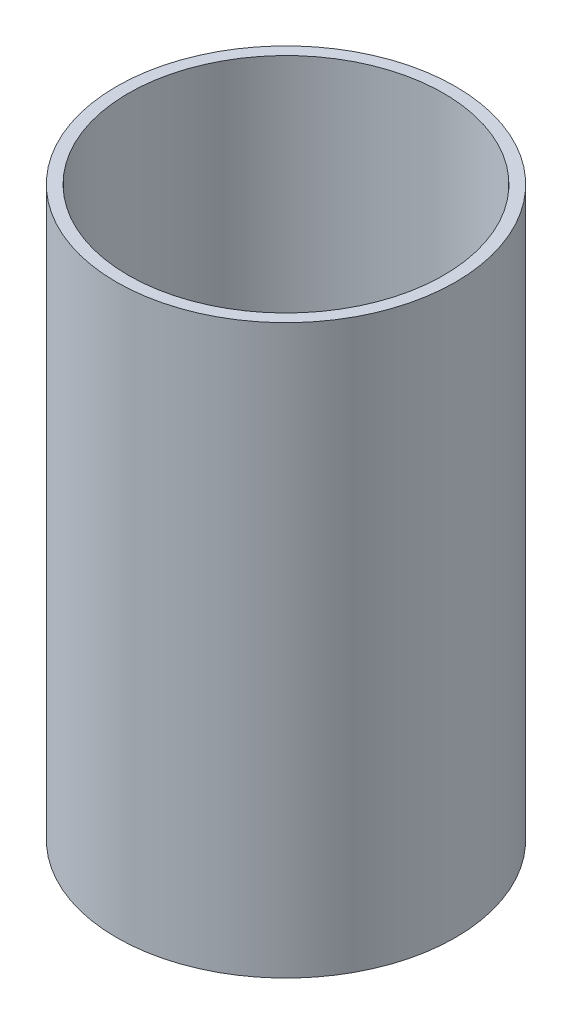
ISO-10303-21;
HEADER;
FILE_DESCRIPTION(('STEP AP214'),'2;1');
FILE_NAME('part.step','',(''),(''),'','','');
FILE_SCHEMA(('AUTOMOTIVE_DESIGN { 1 0 10303 214 1 1 1 1 }'));
ENDSEC;
DATA;
#1=APPLICATION_CONTEXT('core data for automotive mechanical design processes');
#2=APPLICATION_PROTOCOL_DEFINITION('international standard','automotive_design',2000,#1);
#3=PRODUCT_CONTEXT('',#1,'mechanical');
#4=PRODUCT('Part','Part','',(#3));
#5=PRODUCT_RELATED_PRODUCT_CATEGORY('part','',(#4));
#6=PRODUCT_DEFINITION_FORMATION('','',#4);
#7=PRODUCT_DEFINITION_CONTEXT('part definition',#1,'design');
#8=PRODUCT_DEFINITION('design','',#6,#7);
#9=PRODUCT_DEFINITION_SHAPE('','',#8);
#10=(LENGTH_UNIT() NAMED_UNIT(*) SI_UNIT(.MILLI.,.METRE.));
#11=(NAMED_UNIT(*) PLANE_ANGLE_UNIT() SI_UNIT($,.RADIAN.));
#12=(NAMED_UNIT(*) SI_UNIT($,.STERADIAN.) SOLID_ANGLE_UNIT());
#13=UNCERTAINTY_MEASURE_WITH_UNIT(LENGTH_MEASURE(1.E-05),#10,'distance_accuracy_value','');
#14=(GEOMETRIC_REPRESENTATION_CONTEXT(3) GLOBAL_UNCERTAINTY_ASSIGNED_CONTEXT((#13)) GLOBAL_UNIT_ASSIGNED_CONTEXT((#10,
#11,#12)) REPRESENTATION_CONTEXT('',''));
#15=CARTESIAN_POINT('',(0.,0.,0.));
#16=DIRECTION('',(0.,0.,1.));
#17=DIRECTION('',(1.,0.,0.));
#18=AXIS2_PLACEMENT_3D('',#15,#16,#17);
#19=CARTESIAN_POINT('',(0.,91.44,0.));
#20=DIRECTION('',(0.,1.,0.));
#21=DIRECTION('',(0.,0.,1.));
#22=AXIS2_PLACEMENT_3D('',#19,#20,#21);
#23=PLANE('',#22);
#24=CARTESIAN_POINT('',(0.,91.44,0.));
#25=DIRECTION('',(0.,1.,0.));
#26=DIRECTION('',(0.,0.,1.));
#27=AXIS2_PLACEMENT_3D('',#24,#25,#26);
#28=CIRCLE('',#27,27.305);
#29=CARTESIAN_POINT('',(0.,91.44,27.305));
#30=VERTEX_POINT('',#29);
#31=EDGE_CURVE('E10',#30,#30,#28,.T.);
#32=ORIENTED_EDGE('',*,*,#31,.T.);
#33=EDGE_LOOP('',(#32));
#34=FACE_BOUND('',#33,.T.);
#35=CARTESIAN_POINT('',(0.,91.44,0.));
#36=DIRECTION('',(0.,1.,0.));
#37=DIRECTION('',(0.,0.,1.));
#38=AXIS2_PLACEMENT_3D('',#35,#36,#37);
#39=CIRCLE('',#38,25.4);
#40=CARTESIAN_POINT('',(0.,91.44,25.4));
#41=VERTEX_POINT('',#40);
#42=EDGE_CURVE('E48',#41,#41,#39,.T.);
#43=ORIENTED_EDGE('',*,*,#42,.F.);
#44=EDGE_LOOP('',(#43));
#45=FACE_BOUND('',#44,.T.);
#46=ADVANCED_FACE('F37',(#34,#45),#23,.T.);
#47=CARTESIAN_POINT('',(0.,0.,0.));
#48=DIRECTION('',(0.,1.,0.));
#49=DIRECTION('',(0.,0.,1.));
#50=AXIS2_PLACEMENT_3D('',#47,#48,#49);
#51=PLANE('',#50);
#52=CARTESIAN_POINT('',(0.,0.,0.));
#53=DIRECTION('',(0.,1.,0.));
#54=DIRECTION('',(0.,0.,1.));
#55=AXIS2_PLACEMENT_3D('',#52,#53,#54);
#56=CIRCLE('',#55,27.305);
#57=CARTESIAN_POINT('',(0.,0.,27.305));
#58=VERTEX_POINT('',#57);
#59=EDGE_CURVE('E41',#58,#58,#56,.T.);
#60=ORIENTED_EDGE('',*,*,#59,.F.);
#61=EDGE_LOOP('',(#60));
#62=FACE_BOUND('',#61,.T.);
#63=CARTESIAN_POINT('',(0.,0.,0.));
#64=DIRECTION('',(0.,1.,0.));
#65=DIRECTION('',(0.,0.,1.));
#66=AXIS2_PLACEMENT_3D('',#63,#64,#65);
#67=CIRCLE('',#66,25.4);
#68=CARTESIAN_POINT('',(0.,0.,25.4));
#69=VERTEX_POINT('',#68);
#70=EDGE_CURVE('E50',#69,#69,#67,.T.);
#71=ORIENTED_EDGE('',*,*,#70,.T.);
#72=EDGE_LOOP('',(#71));
#73=FACE_BOUND('',#72,.T.);
#74=ADVANCED_FACE('F60',(#62,#73),#51,.F.);
#75=CARTESIAN_POINT('',(0.,91.44,0.));
#76=DIRECTION('',(0.,-1.,0.));
#77=DIRECTION('',(0.,0.,-1.));
#78=AXIS2_PLACEMENT_3D('',#75,#76,#77);
#79=CYLINDRICAL_SURFACE('',#78,27.305);
#80=ORIENTED_EDGE('',*,*,#31,.F.);
#81=EDGE_LOOP('',(#80));
#82=FACE_BOUND('',#81,.T.);
#83=ORIENTED_EDGE('',*,*,#59,.T.);
#84=EDGE_LOOP('',(#83));
#85=FACE_BOUND('',#84,.T.);
#86=ADVANCED_FACE('F39',(#82,#85),#79,.T.);
#87=CARTESIAN_POINT('',(0.,91.44,0.));
#88=DIRECTION('',(0.,-1.,0.));
#89=DIRECTION('',(0.,0.,-1.));
#90=AXIS2_PLACEMENT_3D('',#87,#88,#89);
#91=CYLINDRICAL_SURFACE('',#90,25.4);
#92=ORIENTED_EDGE('',*,*,#42,.T.);
#93=EDGE_LOOP('',(#92));
#94=FACE_BOUND('',#93,.T.);
#95=ORIENTED_EDGE('',*,*,#70,.F.);
#96=EDGE_LOOP('',(#95));
#97=FACE_BOUND('',#96,.T.);
#98=ADVANCED_FACE('F56',(#94,#97),#91,.F.);
#99=CLOSED_SHELL('',(#46,#74,#86,#98));
#100=MANIFOLD_SOLID_BREP('B2',#99);
#101=ADVANCED_BREP_SHAPE_REPRESENTATION('',(#18,#100),#14);
#102=SHAPE_DEFINITION_REPRESENTATION(#9,#101);
ENDSEC;
END-ISO-10303-21;
